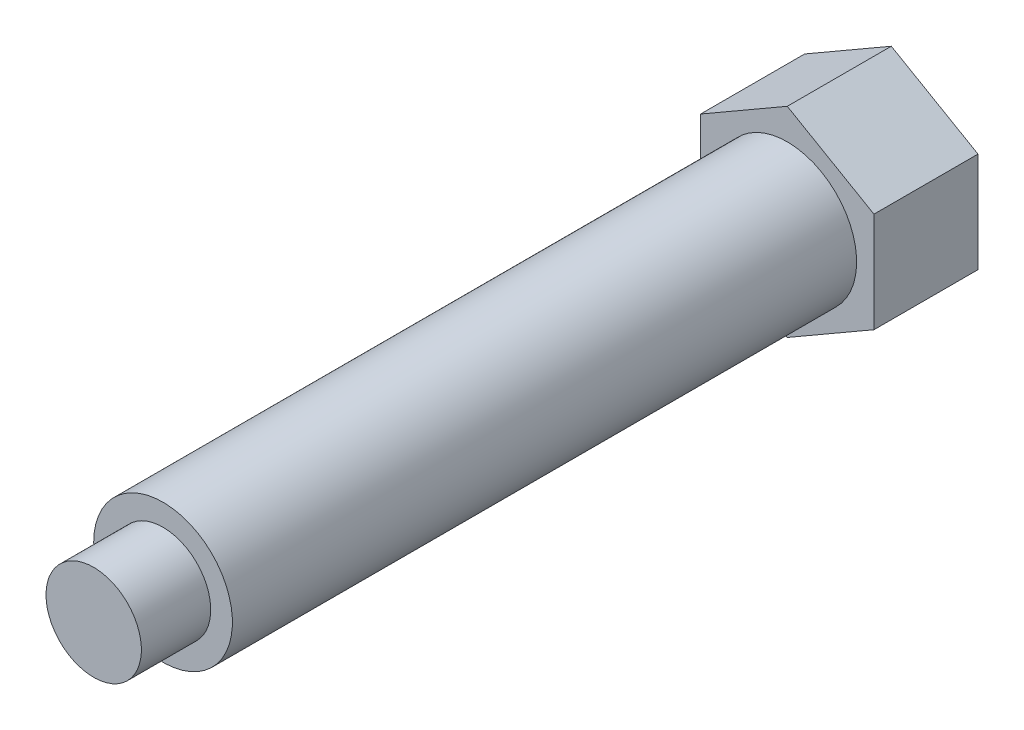
ISO-10303-21;
HEADER;
FILE_DESCRIPTION(('STEP AP214'),'2;1');
FILE_NAME('part.step','',(''),(''),'','','');
FILE_SCHEMA(('AUTOMOTIVE_DESIGN { 1 0 10303 214 1 1 1 1 }'));
ENDSEC;
DATA;
#1=APPLICATION_CONTEXT('core data for automotive mechanical design processes');
#2=APPLICATION_PROTOCOL_DEFINITION('international standard','automotive_design',2000,#1);
#3=PRODUCT_CONTEXT('',#1,'mechanical');
#4=PRODUCT('Part','Part','',(#3));
#5=PRODUCT_RELATED_PRODUCT_CATEGORY('part','',(#4));
#6=PRODUCT_DEFINITION_FORMATION('','',#4);
#7=PRODUCT_DEFINITION_CONTEXT('part definition',#1,'design');
#8=PRODUCT_DEFINITION('design','',#6,#7);
#9=PRODUCT_DEFINITION_SHAPE('','',#8);
#10=(LENGTH_UNIT() NAMED_UNIT(*) SI_UNIT(.MILLI.,.METRE.));
#11=(NAMED_UNIT(*) PLANE_ANGLE_UNIT() SI_UNIT($,.RADIAN.));
#12=(NAMED_UNIT(*) SI_UNIT($,.STERADIAN.) SOLID_ANGLE_UNIT());
#13=UNCERTAINTY_MEASURE_WITH_UNIT(LENGTH_MEASURE(1.E-05),#10,'distance_accuracy_value','');
#14=(GEOMETRIC_REPRESENTATION_CONTEXT(3) GLOBAL_UNCERTAINTY_ASSIGNED_CONTEXT((#13)) GLOBAL_UNIT_ASSIGNED_CONTEXT((#10,
#11,#12)) REPRESENTATION_CONTEXT('',''));
#15=CARTESIAN_POINT('',(0.,0.,0.));
#16=DIRECTION('',(0.,0.,1.));
#17=DIRECTION('',(1.,0.,0.));
#18=AXIS2_PLACEMENT_3D('',#15,#16,#17);
#19=CARTESIAN_POINT('',(0.,0.,40.));
#20=DIRECTION('',(0.,0.,-1.));
#21=DIRECTION('',(-1.,0.,0.));
#22=AXIS2_PLACEMENT_3D('',#19,#20,#21);
#23=PLANE('',#22);
#24=CARTESIAN_POINT('',(0.,0.,40.));
#25=DIRECTION('',(0.,0.,-1.));
#26=DIRECTION('',(-1.,0.,0.));
#27=AXIS2_PLACEMENT_3D('',#24,#25,#26);
#28=CIRCLE('',#27,2.75);
#29=CARTESIAN_POINT('',(-2.75,0.,40.));
#30=VERTEX_POINT('',#29);
#31=EDGE_CURVE('E11',#30,#30,#28,.T.);
#32=ORIENTED_EDGE('',*,*,#31,.F.);
#33=EDGE_LOOP('',(#32));
#34=FACE_BOUND('',#33,.T.);
#35=ADVANCED_FACE('F32',(#34),#23,.F.);
#36=CARTESIAN_POINT('',(0.,0.,-1.18729932832295));
#37=DIRECTION('',(0.,0.,-1.));
#38=DIRECTION('',(-1.,0.,0.));
#39=AXIS2_PLACEMENT_3D('',#36,#37,#38);
#40=CYLINDRICAL_SURFACE('',#39,2.75);
#41=CARTESIAN_POINT('',(0.,0.,36.));
#42=DIRECTION('',(0.,0.,-1.));
#43=DIRECTION('',(-1.,0.,0.));
#44=AXIS2_PLACEMENT_3D('',#41,#42,#43);
#45=CIRCLE('',#44,2.75);
#46=CARTESIAN_POINT('',(-2.75,0.,36.));
#47=VERTEX_POINT('',#46);
#48=EDGE_CURVE('E40',#47,#47,#45,.T.);
#49=ORIENTED_EDGE('',*,*,#48,.F.);
#50=EDGE_LOOP('',(#49));
#51=FACE_BOUND('',#50,.T.);
#52=ORIENTED_EDGE('',*,*,#31,.T.);
#53=EDGE_LOOP('',(#52));
#54=FACE_BOUND('',#53,.T.);
#55=ADVANCED_FACE('F146',(#51,#54),#40,.T.);
#56=CARTESIAN_POINT('',(2.75,0.,36.));
#57=DIRECTION('',(0.,0.,-1.));
#58=DIRECTION('',(-1.,0.,0.));
#59=AXIS2_PLACEMENT_3D('',#56,#57,#58);
#60=PLANE('',#59);
#61=CARTESIAN_POINT('',(0.,0.,36.));
#62=DIRECTION('',(0.,0.,-1.));
#63=DIRECTION('',(-1.,0.,0.));
#64=AXIS2_PLACEMENT_3D('',#61,#62,#63);
#65=CIRCLE('',#64,4.);
#66=CARTESIAN_POINT('',(-4.,0.,36.));
#67=VERTEX_POINT('',#66);
#68=EDGE_CURVE('E139',#67,#67,#65,.T.);
#69=ORIENTED_EDGE('',*,*,#68,.F.);
#70=EDGE_LOOP('',(#69));
#71=FACE_BOUND('',#70,.T.);
#72=ORIENTED_EDGE('',*,*,#48,.T.);
#73=EDGE_LOOP('',(#72));
#74=FACE_BOUND('',#73,.T.);
#75=ADVANCED_FACE('F144',(#71,#74),#60,.F.);
#76=CARTESIAN_POINT('',(0.,0.,-1.18729932832295));
#77=DIRECTION('',(0.,0.,-1.));
#78=DIRECTION('',(-1.,0.,0.));
#79=AXIS2_PLACEMENT_3D('',#76,#77,#78);
#80=CYLINDRICAL_SURFACE('',#79,4.);
#81=CARTESIAN_POINT('',(0.,0.,0.));
#82=DIRECTION('',(0.,0.,-1.));
#83=DIRECTION('',(-1.,0.,0.));
#84=AXIS2_PLACEMENT_3D('',#81,#82,#83);
#85=CIRCLE('',#84,4.00000000000001);
#86=CARTESIAN_POINT('',(-4.00000000000001,0.,0.));
#87=VERTEX_POINT('',#86);
#88=EDGE_CURVE('E136',#87,#87,#85,.T.);
#89=ORIENTED_EDGE('',*,*,#88,.F.);
#90=EDGE_LOOP('',(#89));
#91=FACE_BOUND('',#90,.T.);
#92=ORIENTED_EDGE('',*,*,#68,.T.);
#93=EDGE_LOOP('',(#92));
#94=FACE_BOUND('',#93,.T.);
#95=ADVANCED_FACE('F164',(#91,#94),#80,.T.);
#96=CARTESIAN_POINT('',(-5.,-2.88675134594813,0.));
#97=DIRECTION('',(0.,0.,-1.));
#98=DIRECTION('',(-1.,0.,0.));
#99=AXIS2_PLACEMENT_3D('',#96,#97,#98);
#100=PLANE('',#99);
#101=DIRECTION('',(-0.866025403784439,0.5,0.));
#102=VECTOR('',#101,1.);
#103=CARTESIAN_POINT('',(0.,-5.77350269189626,0.));
#104=LINE('',#103,#102);
#105=CARTESIAN_POINT('',(0.,-5.77350269189626,0.));
#106=VERTEX_POINT('',#105);
#107=CARTESIAN_POINT('',(-5.,-2.88675134594813,0.));
#108=VERTEX_POINT('',#107);
#109=EDGE_CURVE('E117',#106,#108,#104,.T.);
#110=ORIENTED_EDGE('',*,*,#109,.F.);
#111=DIRECTION('',(-0.866025403784439,-0.5,0.));
#112=VECTOR('',#111,1.);
#113=CARTESIAN_POINT('',(5.,-2.88675134594813,0.));
#114=LINE('',#113,#112);
#115=CARTESIAN_POINT('',(5.,-2.88675134594813,0.));
#116=VERTEX_POINT('',#115);
#117=EDGE_CURVE('E77',#116,#106,#114,.T.);
#118=ORIENTED_EDGE('',*,*,#117,.F.);
#119=DIRECTION('',(0.,-1.,0.));
#120=VECTOR('',#119,1.);
#121=CARTESIAN_POINT('',(5.,2.88675134594813,0.));
#122=LINE('',#121,#120);
#123=CARTESIAN_POINT('',(5.,2.88675134594813,0.));
#124=VERTEX_POINT('',#123);
#125=EDGE_CURVE('E71',#124,#116,#122,.T.);
#126=ORIENTED_EDGE('',*,*,#125,.F.);
#127=DIRECTION('',(0.866025403784439,-0.5,0.));
#128=VECTOR('',#127,1.);
#129=CARTESIAN_POINT('',(0.,5.77350269189626,0.));
#130=LINE('',#129,#128);
#131=CARTESIAN_POINT('',(0.,5.77350269189626,0.));
#132=VERTEX_POINT('',#131);
#133=EDGE_CURVE('E107',#132,#124,#130,.T.);
#134=ORIENTED_EDGE('',*,*,#133,.F.);
#135=DIRECTION('',(0.866025403784439,0.5,0.));
#136=VECTOR('',#135,1.);
#137=CARTESIAN_POINT('',(-5.,2.88675134594813,0.));
#138=LINE('',#137,#136);
#139=CARTESIAN_POINT('',(-5.,2.88675134594813,0.));
#140=VERTEX_POINT('',#139);
#141=EDGE_CURVE('E122',#140,#132,#138,.T.);
#142=ORIENTED_EDGE('',*,*,#141,.F.);
#143=DIRECTION('',(0.,1.,0.));
#144=VECTOR('',#143,1.);
#145=CARTESIAN_POINT('',(-5.,-2.88675134594813,0.));
#146=LINE('',#145,#144);
#147=EDGE_CURVE('E120',#108,#140,#146,.T.);
#148=ORIENTED_EDGE('',*,*,#147,.F.);
#149=EDGE_LOOP('',(#110,#118,#126,#134,#142,#148));
#150=FACE_BOUND('',#149,.T.);
#151=ORIENTED_EDGE('',*,*,#88,.T.);
#152=EDGE_LOOP('',(#151));
#153=FACE_BOUND('',#152,.T.);
#154=ADVANCED_FACE('F172',(#150,#153),#100,.F.);
#155=CARTESIAN_POINT('',(0.,-5.77350269189626,-6.));
#156=DIRECTION('',(0.5,0.866025403784439,0.));
#157=DIRECTION('',(-0.866025403784439,0.5,0.));
#158=AXIS2_PLACEMENT_3D('',#155,#156,#157);
#159=PLANE('',#158);
#160=ORIENTED_EDGE('',*,*,#109,.T.);
#161=DIRECTION('',(0.,0.,1.));
#162=VECTOR('',#161,1.);
#163=CARTESIAN_POINT('',(-5.,-2.88675134594813,-6.));
#164=LINE('',#163,#162);
#165=CARTESIAN_POINT('',(-5.,-2.88675134594813,-6.));
#166=VERTEX_POINT('',#165);
#167=EDGE_CURVE('E134',#166,#108,#164,.T.);
#168=ORIENTED_EDGE('',*,*,#167,.F.);
#169=DIRECTION('',(-0.866025403784439,0.5,0.));
#170=VECTOR('',#169,1.);
#171=CARTESIAN_POINT('',(0.,-5.77350269189626,-6.));
#172=LINE('',#171,#170);
#173=CARTESIAN_POINT('',(0.,-5.77350269189626,-6.));
#174=VERTEX_POINT('',#173);
#175=EDGE_CURVE('E127',#174,#166,#172,.T.);
#176=ORIENTED_EDGE('',*,*,#175,.F.);
#177=DIRECTION('',(0.,0.,1.));
#178=VECTOR('',#177,1.);
#179=CARTESIAN_POINT('',(0.,-5.77350269189626,-6.));
#180=LINE('',#179,#178);
#181=EDGE_CURVE('E113',#174,#106,#180,.T.);
#182=ORIENTED_EDGE('',*,*,#181,.T.);
#183=EDGE_LOOP('',(#160,#168,#176,#182));
#184=FACE_BOUND('',#183,.T.);
#185=ADVANCED_FACE('F180',(#184),#159,.F.);
#186=CARTESIAN_POINT('',(-5.,-2.88675134594813,-6.));
#187=DIRECTION('',(1.,0.,0.));
#188=DIRECTION('',(0.,1.,0.));
#189=AXIS2_PLACEMENT_3D('',#186,#187,#188);
#190=PLANE('',#189);
#191=ORIENTED_EDGE('',*,*,#147,.T.);
#192=DIRECTION('',(0.,0.,1.));
#193=VECTOR('',#192,1.);
#194=CARTESIAN_POINT('',(-5.,2.88675134594813,-6.));
#195=LINE('',#194,#193);
#196=CARTESIAN_POINT('',(-5.,2.88675134594813,-6.));
#197=VERTEX_POINT('',#196);
#198=EDGE_CURVE('E131',#197,#140,#195,.T.);
#199=ORIENTED_EDGE('',*,*,#198,.F.);
#200=DIRECTION('',(0.,1.,0.));
#201=VECTOR('',#200,1.);
#202=CARTESIAN_POINT('',(-5.,-2.88675134594813,-6.));
#203=LINE('',#202,#201);
#204=EDGE_CURVE('E86',#166,#197,#203,.T.);
#205=ORIENTED_EDGE('',*,*,#204,.F.);
#206=ORIENTED_EDGE('',*,*,#167,.T.);
#207=EDGE_LOOP('',(#191,#199,#205,#206));
#208=FACE_BOUND('',#207,.T.);
#209=ADVANCED_FACE('F188',(#208),#190,.F.);
#210=CARTESIAN_POINT('',(-5.,2.88675134594813,-6.));
#211=DIRECTION('',(0.5,-0.866025403784439,0.));
#212=DIRECTION('',(0.866025403784439,0.5,0.));
#213=AXIS2_PLACEMENT_3D('',#210,#211,#212);
#214=PLANE('',#213);
#215=ORIENTED_EDGE('',*,*,#141,.T.);
#216=DIRECTION('',(0.,0.,1.));
#217=VECTOR('',#216,1.);
#218=CARTESIAN_POINT('',(0.,5.77350269189626,-6.));
#219=LINE('',#218,#217);
#220=CARTESIAN_POINT('',(0.,5.77350269189626,-6.));
#221=VERTEX_POINT('',#220);
#222=EDGE_CURVE('E108',#221,#132,#219,.T.);
#223=ORIENTED_EDGE('',*,*,#222,.F.);
#224=DIRECTION('',(0.866025403784439,0.5,0.));
#225=VECTOR('',#224,1.);
#226=CARTESIAN_POINT('',(-5.,2.88675134594813,-6.));
#227=LINE('',#226,#225);
#228=EDGE_CURVE('E99',#197,#221,#227,.T.);
#229=ORIENTED_EDGE('',*,*,#228,.F.);
#230=ORIENTED_EDGE('',*,*,#198,.T.);
#231=EDGE_LOOP('',(#215,#223,#229,#230));
#232=FACE_BOUND('',#231,.T.);
#233=ADVANCED_FACE('F196',(#232),#214,.F.);
#234=CARTESIAN_POINT('',(0.,5.77350269189626,-6.));
#235=DIRECTION('',(-0.5,-0.866025403784439,0.));
#236=DIRECTION('',(0.866025403784439,-0.5,0.));
#237=AXIS2_PLACEMENT_3D('',#234,#235,#236);
#238=PLANE('',#237);
#239=ORIENTED_EDGE('',*,*,#133,.T.);
#240=DIRECTION('',(0.,0.,1.));
#241=VECTOR('',#240,1.);
#242=CARTESIAN_POINT('',(5.,2.88675134594813,-6.));
#243=LINE('',#242,#241);
#244=CARTESIAN_POINT('',(5.,2.88675134594813,-6.));
#245=VERTEX_POINT('',#244);
#246=EDGE_CURVE('E104',#245,#124,#243,.T.);
#247=ORIENTED_EDGE('',*,*,#246,.F.);
#248=DIRECTION('',(0.866025403784439,-0.5,0.));
#249=VECTOR('',#248,1.);
#250=CARTESIAN_POINT('',(0.,5.77350269189626,-6.));
#251=LINE('',#250,#249);
#252=EDGE_CURVE('E93',#221,#245,#251,.T.);
#253=ORIENTED_EDGE('',*,*,#252,.F.);
#254=ORIENTED_EDGE('',*,*,#222,.T.);
#255=EDGE_LOOP('',(#239,#247,#253,#254));
#256=FACE_BOUND('',#255,.T.);
#257=ADVANCED_FACE('F105',(#256),#238,.F.);
#258=CARTESIAN_POINT('',(5.,2.88675134594813,-6.));
#259=DIRECTION('',(-1.,0.,0.));
#260=DIRECTION('',(0.,0.,1.));
#261=AXIS2_PLACEMENT_3D('',#258,#259,#260);
#262=PLANE('',#261);
#263=ORIENTED_EDGE('',*,*,#125,.T.);
#264=DIRECTION('',(0.,0.,1.));
#265=VECTOR('',#264,1.);
#266=CARTESIAN_POINT('',(5.,-2.88675134594813,-6.));
#267=LINE('',#266,#265);
#268=CARTESIAN_POINT('',(5.,-2.88675134594813,-6.));
#269=VERTEX_POINT('',#268);
#270=EDGE_CURVE('E109',#269,#116,#267,.T.);
#271=ORIENTED_EDGE('',*,*,#270,.F.);
#272=DIRECTION('',(0.,-1.,0.));
#273=VECTOR('',#272,1.);
#274=CARTESIAN_POINT('',(5.,2.88675134594813,-6.));
#275=LINE('',#274,#273);
#276=EDGE_CURVE('E97',#245,#269,#275,.T.);
#277=ORIENTED_EDGE('',*,*,#276,.F.);
#278=ORIENTED_EDGE('',*,*,#246,.T.);
#279=EDGE_LOOP('',(#263,#271,#277,#278));
#280=FACE_BOUND('',#279,.T.);
#281=ADVANCED_FACE('F111',(#280),#262,.F.);
#282=CARTESIAN_POINT('',(5.,-2.88675134594813,-6.));
#283=DIRECTION('',(-0.5,0.866025403784438,0.));
#284=DIRECTION('',(-0.866025403784439,-0.5,0.));
#285=AXIS2_PLACEMENT_3D('',#282,#283,#284);
#286=PLANE('',#285);
#287=ORIENTED_EDGE('',*,*,#117,.T.);
#288=ORIENTED_EDGE('',*,*,#181,.F.);
#289=DIRECTION('',(-0.866025403784439,-0.5,0.));
#290=VECTOR('',#289,1.);
#291=CARTESIAN_POINT('',(5.,-2.88675134594813,-6.));
#292=LINE('',#291,#290);
#293=EDGE_CURVE('E48',#269,#174,#292,.T.);
#294=ORIENTED_EDGE('',*,*,#293,.F.);
#295=ORIENTED_EDGE('',*,*,#270,.T.);
#296=EDGE_LOOP('',(#287,#288,#294,#295));
#297=FACE_BOUND('',#296,.T.);
#298=ADVANCED_FACE('F216',(#297),#286,.F.);
#299=CARTESIAN_POINT('',(-5.,-2.88675134594813,-6.));
#300=DIRECTION('',(0.,0.,-1.));
#301=DIRECTION('',(-1.,0.,0.));
#302=AXIS2_PLACEMENT_3D('',#299,#300,#301);
#303=PLANE('',#302);
#304=ORIENTED_EDGE('',*,*,#175,.T.);
#305=ORIENTED_EDGE('',*,*,#204,.T.);
#306=ORIENTED_EDGE('',*,*,#228,.T.);
#307=ORIENTED_EDGE('',*,*,#252,.T.);
#308=ORIENTED_EDGE('',*,*,#276,.T.);
#309=ORIENTED_EDGE('',*,*,#293,.T.);
#310=EDGE_LOOP('',(#304,#305,#306,#307,#308,#309));
#311=FACE_BOUND('',#310,.T.);
#312=ADVANCED_FACE('F95',(#311),#303,.T.);
#313=CLOSED_SHELL('',(#35,#55,#75,#95,#154,#185,#209,#233,#257,#281,#298,#312));
#314=MANIFOLD_SOLID_BREP('B2',#313);
#315=ADVANCED_BREP_SHAPE_REPRESENTATION('',(#18,#314),#14);
#316=SHAPE_DEFINITION_REPRESENTATION(#9,#315);
ENDSEC;
END-ISO-10303-21;
